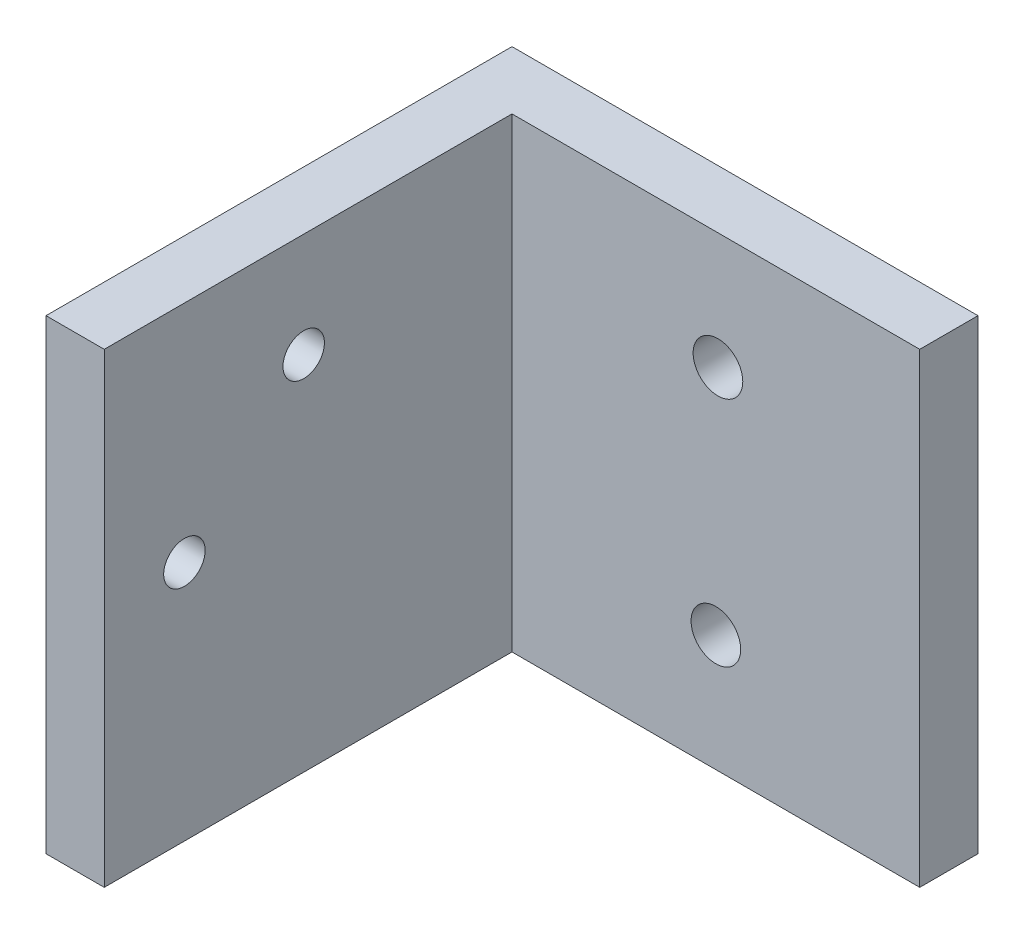
ISO-10303-21;
HEADER;
FILE_DESCRIPTION(('STEP AP214'),'2;1');
FILE_NAME('part.step','',(''),(''),'','','');
FILE_SCHEMA(('AUTOMOTIVE_DESIGN { 1 0 10303 214 1 1 1 1 }'));
ENDSEC;
DATA;
#1=APPLICATION_CONTEXT('core data for automotive mechanical design processes');
#2=APPLICATION_PROTOCOL_DEFINITION('international standard','automotive_design',2000,#1);
#3=PRODUCT_CONTEXT('',#1,'mechanical');
#4=PRODUCT('Part','Part','',(#3));
#5=PRODUCT_RELATED_PRODUCT_CATEGORY('part','',(#4));
#6=PRODUCT_DEFINITION_FORMATION('','',#4);
#7=PRODUCT_DEFINITION_CONTEXT('part definition',#1,'design');
#8=PRODUCT_DEFINITION('design','',#6,#7);
#9=PRODUCT_DEFINITION_SHAPE('','',#8);
#10=(LENGTH_UNIT() NAMED_UNIT(*) SI_UNIT(.MILLI.,.METRE.));
#11=(NAMED_UNIT(*) PLANE_ANGLE_UNIT() SI_UNIT($,.RADIAN.));
#12=(NAMED_UNIT(*) SI_UNIT($,.STERADIAN.) SOLID_ANGLE_UNIT());
#13=UNCERTAINTY_MEASURE_WITH_UNIT(LENGTH_MEASURE(1.E-05),#10,'distance_accuracy_value','');
#14=(GEOMETRIC_REPRESENTATION_CONTEXT(3) GLOBAL_UNCERTAINTY_ASSIGNED_CONTEXT((#13)) GLOBAL_UNIT_ASSIGNED_CONTEXT((#10,
#11,#12)) REPRESENTATION_CONTEXT('',''));
#15=CARTESIAN_POINT('',(0.,0.,0.));
#16=DIRECTION('',(0.,0.,1.));
#17=DIRECTION('',(1.,0.,0.));
#18=AXIS2_PLACEMENT_3D('',#15,#16,#17);
#19=CARTESIAN_POINT('',(-32.776603547062,25.4,0.));
#20=DIRECTION('',(-1.,0.,0.));
#21=DIRECTION('',(0.,0.,1.));
#22=AXIS2_PLACEMENT_3D('',#19,#20,#21);
#23=PLANE('',#22);
#24=CARTESIAN_POINT('',(-32.776603547062,19.7104,16.5203569987366));
#25=DIRECTION('',(-1.,0.,0.));
#26=DIRECTION('',(0.,0.,1.));
#27=AXIS2_PLACEMENT_3D('',#24,#25,#26);
#28=CIRCLE('',#27,1.1303);
#29=CARTESIAN_POINT('',(-32.776603547062,19.7104,17.6506569987366));
#30=VERTEX_POINT('',#29);
#31=EDGE_CURVE('E178',#30,#30,#28,.T.);
#32=ORIENTED_EDGE('',*,*,#31,.T.);
#33=EDGE_LOOP('',(#32));
#34=FACE_BOUND('',#33,.T.);
#35=CARTESIAN_POINT('',(-32.776603547062,13.1572,23.0227569987366));
#36=DIRECTION('',(-1.,0.,0.));
#37=DIRECTION('',(0.,0.,1.));
#38=AXIS2_PLACEMENT_3D('',#35,#36,#37);
#39=CIRCLE('',#38,1.1303);
#40=CARTESIAN_POINT('',(-32.776603547062,13.1572,24.1530569987366));
#41=VERTEX_POINT('',#40);
#42=EDGE_CURVE('E135',#41,#41,#39,.T.);
#43=ORIENTED_EDGE('',*,*,#42,.T.);
#44=EDGE_LOOP('',(#43));
#45=FACE_BOUND('',#44,.T.);
#46=DIRECTION('',(0.,0.,-1.));
#47=VECTOR('',#46,1.);
#48=CARTESIAN_POINT('',(-32.776603547062,0.,0.));
#49=LINE('',#48,#47);
#50=CARTESIAN_POINT('',(-32.776603547062,0.,27.3915569987366));
#51=VERTEX_POINT('',#50);
#52=CARTESIAN_POINT('',(-32.776603547062,0.,5.16655699873663));
#53=VERTEX_POINT('',#52);
#54=EDGE_CURVE('E131',#51,#53,#49,.T.);
#55=ORIENTED_EDGE('',*,*,#54,.T.);
#56=DIRECTION('',(0.,-1.,0.));
#57=VECTOR('',#56,1.);
#58=CARTESIAN_POINT('',(-32.776603547062,25.4,5.16655699873663));
#59=LINE('',#58,#57);
#60=CARTESIAN_POINT('',(-32.776603547062,25.4,5.16655699873663));
#61=VERTEX_POINT('',#60);
#62=EDGE_CURVE('E13',#61,#53,#59,.T.);
#63=ORIENTED_EDGE('',*,*,#62,.F.);
#64=DIRECTION('',(0.,0.,-1.));
#65=VECTOR('',#64,1.);
#66=CARTESIAN_POINT('',(-32.776603547062,25.4,0.));
#67=LINE('',#66,#65);
#68=CARTESIAN_POINT('',(-32.776603547062,25.4,27.3915569987366));
#69=VERTEX_POINT('',#68);
#70=EDGE_CURVE('E144',#69,#61,#67,.T.);
#71=ORIENTED_EDGE('',*,*,#70,.F.);
#72=DIRECTION('',(0.,-1.,0.));
#73=VECTOR('',#72,1.);
#74=CARTESIAN_POINT('',(-32.776603547062,25.4,27.3915569987366));
#75=LINE('',#74,#73);
#76=EDGE_CURVE('E130',#69,#51,#75,.T.);
#77=ORIENTED_EDGE('',*,*,#76,.T.);
#78=EDGE_LOOP('',(#55,#63,#71,#77));
#79=FACE_BOUND('',#78,.T.);
#80=ADVANCED_FACE('F46',(#34,#45,#79),#23,.F.);
#81=CARTESIAN_POINT('',(0.,25.4,5.16655699873663));
#82=DIRECTION('',(0.,0.,-1.));
#83=DIRECTION('',(-1.,0.,0.));
#84=AXIS2_PLACEMENT_3D('',#81,#82,#83);
#85=PLANE('',#84);
#86=CARTESIAN_POINT('',(-21.664103547062,6.35,5.16655699873663));
#87=DIRECTION('',(0.,0.,1.));
#88=DIRECTION('',(1.,0.,0.));
#89=AXIS2_PLACEMENT_3D('',#86,#87,#88);
#90=CIRCLE('',#89,1.35255);
#91=CARTESIAN_POINT('',(-20.311553547062,6.35,5.16655699873663));
#92=VERTEX_POINT('',#91);
#93=EDGE_CURVE('E198',#92,#92,#90,.T.);
#94=ORIENTED_EDGE('',*,*,#93,.F.);
#95=EDGE_LOOP('',(#94));
#96=FACE_BOUND('',#95,.T.);
#97=CARTESIAN_POINT('',(-21.5506395801981,19.05,5.16655699873663));
#98=DIRECTION('',(0.,0.,1.));
#99=DIRECTION('',(1.,0.,0.));
#100=AXIS2_PLACEMENT_3D('',#97,#98,#99);
#101=CIRCLE('',#100,1.35255);
#102=CARTESIAN_POINT('',(-20.1980895801981,19.05,5.16655699873663));
#103=VERTEX_POINT('',#102);
#104=EDGE_CURVE('E195',#103,#103,#101,.T.);
#105=ORIENTED_EDGE('',*,*,#104,.F.);
#106=EDGE_LOOP('',(#105));
#107=FACE_BOUND('',#106,.T.);
#108=DIRECTION('',(1.,0.,0.));
#109=VECTOR('',#108,1.);
#110=CARTESIAN_POINT('',(0.,0.,5.16655699873663));
#111=LINE('',#110,#109);
#112=CARTESIAN_POINT('',(-10.551603547062,0.,5.16655699873663));
#113=VERTEX_POINT('',#112);
#114=EDGE_CURVE('E134',#53,#113,#111,.T.);
#115=ORIENTED_EDGE('',*,*,#114,.T.);
#116=DIRECTION('',(0.,-1.,0.));
#117=VECTOR('',#116,1.);
#118=CARTESIAN_POINT('',(-10.551603547062,25.4,5.16655699873663));
#119=LINE('',#118,#117);
#120=CARTESIAN_POINT('',(-10.551603547062,25.4,5.16655699873663));
#121=VERTEX_POINT('',#120);
#122=EDGE_CURVE('E55',#121,#113,#119,.T.);
#123=ORIENTED_EDGE('',*,*,#122,.F.);
#124=DIRECTION('',(1.,0.,0.));
#125=VECTOR('',#124,1.);
#126=CARTESIAN_POINT('',(0.,25.4,5.16655699873663));
#127=LINE('',#126,#125);
#128=EDGE_CURVE('E99',#61,#121,#127,.T.);
#129=ORIENTED_EDGE('',*,*,#128,.F.);
#130=ORIENTED_EDGE('',*,*,#62,.T.);
#131=EDGE_LOOP('',(#115,#123,#129,#130));
#132=FACE_BOUND('',#131,.T.);
#133=ADVANCED_FACE('F151',(#96,#107,#132),#85,.F.);
#134=CARTESIAN_POINT('',(-10.551603547062,25.4,0.));
#135=DIRECTION('',(1.,0.,0.));
#136=DIRECTION('',(0.,0.,-1.));
#137=AXIS2_PLACEMENT_3D('',#134,#135,#136);
#138=PLANE('',#137);
#139=DIRECTION('',(0.,0.,1.));
#140=VECTOR('',#139,1.);
#141=CARTESIAN_POINT('',(-10.551603547062,0.,0.));
#142=LINE('',#141,#140);
#143=CARTESIAN_POINT('',(-10.551603547062,0.,1.99155699873663));
#144=VERTEX_POINT('',#143);
#145=EDGE_CURVE('E138',#144,#113,#142,.T.);
#146=ORIENTED_EDGE('',*,*,#145,.F.);
#147=DIRECTION('',(0.,-1.,0.));
#148=VECTOR('',#147,1.);
#149=CARTESIAN_POINT('',(-10.551603547062,25.4,1.99155699873663));
#150=LINE('',#149,#148);
#151=CARTESIAN_POINT('',(-10.551603547062,25.4,1.99155699873663));
#152=VERTEX_POINT('',#151);
#153=EDGE_CURVE('E115',#152,#144,#150,.T.);
#154=ORIENTED_EDGE('',*,*,#153,.F.);
#155=DIRECTION('',(0.,0.,1.));
#156=VECTOR('',#155,1.);
#157=CARTESIAN_POINT('',(-10.551603547062,25.4,0.));
#158=LINE('',#157,#156);
#159=EDGE_CURVE('E124',#152,#121,#158,.T.);
#160=ORIENTED_EDGE('',*,*,#159,.T.);
#161=ORIENTED_EDGE('',*,*,#122,.T.);
#162=EDGE_LOOP('',(#146,#154,#160,#161));
#163=FACE_BOUND('',#162,.T.);
#164=ADVANCED_FACE('F150',(#163),#138,.T.);
#165=CARTESIAN_POINT('',(0.,25.4,1.99155699873663));
#166=DIRECTION('',(0.,0.,-1.));
#167=DIRECTION('',(-1.,0.,0.));
#168=AXIS2_PLACEMENT_3D('',#165,#166,#167);
#169=PLANE('',#168);
#170=CARTESIAN_POINT('',(-21.664103547062,6.35,1.99155699873663));
#171=DIRECTION('',(0.,0.,-1.));
#172=DIRECTION('',(-1.,0.,0.));
#173=AXIS2_PLACEMENT_3D('',#170,#171,#172);
#174=CIRCLE('',#173,1.35255);
#175=CARTESIAN_POINT('',(-23.016653547062,6.35,1.99155699873663));
#176=VERTEX_POINT('',#175);
#177=EDGE_CURVE('E49',#176,#176,#174,.T.);
#178=ORIENTED_EDGE('',*,*,#177,.F.);
#179=EDGE_LOOP('',(#178));
#180=FACE_BOUND('',#179,.T.);
#181=CARTESIAN_POINT('',(-21.5506395801981,19.05,1.99155699873663));
#182=DIRECTION('',(0.,0.,-1.));
#183=DIRECTION('',(-1.,0.,0.));
#184=AXIS2_PLACEMENT_3D('',#181,#182,#183);
#185=CIRCLE('',#184,1.35255);
#186=CARTESIAN_POINT('',(-22.9031895801981,19.05,1.99155699873663));
#187=VERTEX_POINT('',#186);
#188=EDGE_CURVE('E192',#187,#187,#185,.T.);
#189=ORIENTED_EDGE('',*,*,#188,.F.);
#190=EDGE_LOOP('',(#189));
#191=FACE_BOUND('',#190,.T.);
#192=DIRECTION('',(1.,0.,0.));
#193=VECTOR('',#192,1.);
#194=CARTESIAN_POINT('',(0.,0.,1.99155699873663));
#195=LINE('',#194,#193);
#196=CARTESIAN_POINT('',(-35.9516035470619,0.,1.99155699873663));
#197=VERTEX_POINT('',#196);
#198=EDGE_CURVE('E114',#197,#144,#195,.T.);
#199=ORIENTED_EDGE('',*,*,#198,.F.);
#200=DIRECTION('',(0.,-1.,0.));
#201=VECTOR('',#200,1.);
#202=CARTESIAN_POINT('',(-35.9516035470619,25.4,1.99155699873663));
#203=LINE('',#202,#201);
#204=CARTESIAN_POINT('',(-35.9516035470619,25.4,1.99155699873663));
#205=VERTEX_POINT('',#204);
#206=EDGE_CURVE('E108',#205,#197,#203,.T.);
#207=ORIENTED_EDGE('',*,*,#206,.F.);
#208=DIRECTION('',(1.,0.,0.));
#209=VECTOR('',#208,1.);
#210=CARTESIAN_POINT('',(0.,25.4,1.99155699873663));
#211=LINE('',#210,#209);
#212=EDGE_CURVE('E112',#205,#152,#211,.T.);
#213=ORIENTED_EDGE('',*,*,#212,.T.);
#214=ORIENTED_EDGE('',*,*,#153,.T.);
#215=EDGE_LOOP('',(#199,#207,#213,#214));
#216=FACE_BOUND('',#215,.T.);
#217=ADVANCED_FACE('F110',(#180,#191,#216),#169,.T.);
#218=CARTESIAN_POINT('',(-35.9516035470619,25.4,0.));
#219=DIRECTION('',(1.,0.,0.));
#220=DIRECTION('',(0.,0.,-1.));
#221=AXIS2_PLACEMENT_3D('',#218,#219,#220);
#222=PLANE('',#221);
#223=CARTESIAN_POINT('',(-35.9516035470619,19.7104,16.5203569987366));
#224=DIRECTION('',(-1.,0.,0.));
#225=DIRECTION('',(0.,0.,1.));
#226=AXIS2_PLACEMENT_3D('',#223,#224,#225);
#227=CIRCLE('',#226,1.1303);
#228=CARTESIAN_POINT('',(-35.9516035470619,19.7104,17.6506569987366));
#229=VERTEX_POINT('',#228);
#230=EDGE_CURVE('E189',#229,#229,#227,.T.);
#231=ORIENTED_EDGE('',*,*,#230,.F.);
#232=EDGE_LOOP('',(#231));
#233=FACE_BOUND('',#232,.T.);
#234=CARTESIAN_POINT('',(-35.9516035470619,13.1572,23.0227569987366));
#235=DIRECTION('',(-1.,0.,0.));
#236=DIRECTION('',(0.,0.,1.));
#237=AXIS2_PLACEMENT_3D('',#234,#235,#236);
#238=CIRCLE('',#237,1.1303);
#239=CARTESIAN_POINT('',(-35.9516035470619,13.1572,24.1530569987366));
#240=VERTEX_POINT('',#239);
#241=EDGE_CURVE('E182',#240,#240,#238,.T.);
#242=ORIENTED_EDGE('',*,*,#241,.F.);
#243=EDGE_LOOP('',(#242));
#244=FACE_BOUND('',#243,.T.);
#245=DIRECTION('',(0.,0.,1.));
#246=VECTOR('',#245,1.);
#247=CARTESIAN_POINT('',(-35.9516035470619,0.,0.));
#248=LINE('',#247,#246);
#249=CARTESIAN_POINT('',(-35.9516035470619,0.,27.3915569987366));
#250=VERTEX_POINT('',#249);
#251=EDGE_CURVE('E85',#197,#250,#248,.T.);
#252=ORIENTED_EDGE('',*,*,#251,.T.);
#253=DIRECTION('',(0.,-1.,0.));
#254=VECTOR('',#253,1.);
#255=CARTESIAN_POINT('',(-35.9516035470619,25.4,27.3915569987366));
#256=LINE('',#255,#254);
#257=CARTESIAN_POINT('',(-35.9516035470619,25.4,27.3915569987366));
#258=VERTEX_POINT('',#257);
#259=EDGE_CURVE('E116',#258,#250,#256,.T.);
#260=ORIENTED_EDGE('',*,*,#259,.F.);
#261=DIRECTION('',(0.,0.,1.));
#262=VECTOR('',#261,1.);
#263=CARTESIAN_POINT('',(-35.9516035470619,25.4,0.));
#264=LINE('',#263,#262);
#265=EDGE_CURVE('E118',#205,#258,#264,.T.);
#266=ORIENTED_EDGE('',*,*,#265,.F.);
#267=ORIENTED_EDGE('',*,*,#206,.T.);
#268=EDGE_LOOP('',(#252,#260,#266,#267));
#269=FACE_BOUND('',#268,.T.);
#270=ADVANCED_FACE('F119',(#233,#244,#269),#222,.F.);
#271=CARTESIAN_POINT('',(0.,25.4,27.3915569987366));
#272=DIRECTION('',(0.,0.,-1.));
#273=DIRECTION('',(-1.,0.,0.));
#274=AXIS2_PLACEMENT_3D('',#271,#272,#273);
#275=PLANE('',#274);
#276=DIRECTION('',(1.,0.,0.));
#277=VECTOR('',#276,1.);
#278=CARTESIAN_POINT('',(0.,0.,27.3915569987366));
#279=LINE('',#278,#277);
#280=EDGE_CURVE('E91',#250,#51,#279,.T.);
#281=ORIENTED_EDGE('',*,*,#280,.T.);
#282=ORIENTED_EDGE('',*,*,#76,.F.);
#283=DIRECTION('',(1.,0.,0.));
#284=VECTOR('',#283,1.);
#285=CARTESIAN_POINT('',(0.,25.4,27.3915569987366));
#286=LINE('',#285,#284);
#287=EDGE_CURVE('E63',#258,#69,#286,.T.);
#288=ORIENTED_EDGE('',*,*,#287,.F.);
#289=ORIENTED_EDGE('',*,*,#259,.T.);
#290=EDGE_LOOP('',(#281,#282,#288,#289));
#291=FACE_BOUND('',#290,.T.);
#292=ADVANCED_FACE('F158',(#291),#275,.F.);
#293=CARTESIAN_POINT('',(0.,25.4,0.));
#294=DIRECTION('',(0.,1.,0.));
#295=DIRECTION('',(0.,0.,1.));
#296=AXIS2_PLACEMENT_3D('',#293,#294,#295);
#297=PLANE('',#296);
#298=ORIENTED_EDGE('',*,*,#70,.T.);
#299=ORIENTED_EDGE('',*,*,#128,.T.);
#300=ORIENTED_EDGE('',*,*,#159,.F.);
#301=ORIENTED_EDGE('',*,*,#212,.F.);
#302=ORIENTED_EDGE('',*,*,#265,.T.);
#303=ORIENTED_EDGE('',*,*,#287,.T.);
#304=EDGE_LOOP('',(#298,#299,#300,#301,#302,#303));
#305=FACE_BOUND('',#304,.T.);
#306=ADVANCED_FACE('F122',(#305),#297,.T.);
#307=CARTESIAN_POINT('',(0.,0.,0.));
#308=DIRECTION('',(0.,1.,0.));
#309=DIRECTION('',(0.,0.,1.));
#310=AXIS2_PLACEMENT_3D('',#307,#308,#309);
#311=PLANE('',#310);
#312=ORIENTED_EDGE('',*,*,#54,.F.);
#313=ORIENTED_EDGE('',*,*,#280,.F.);
#314=ORIENTED_EDGE('',*,*,#251,.F.);
#315=ORIENTED_EDGE('',*,*,#198,.T.);
#316=ORIENTED_EDGE('',*,*,#145,.T.);
#317=ORIENTED_EDGE('',*,*,#114,.F.);
#318=EDGE_LOOP('',(#312,#313,#314,#315,#316,#317));
#319=FACE_BOUND('',#318,.T.);
#320=ADVANCED_FACE('F155',(#319),#311,.F.);
#321=CARTESIAN_POINT('',(-35.9516035470619,13.1572,23.0227569987366));
#322=DIRECTION('',(-1.,0.,0.));
#323=DIRECTION('',(0.,0.,1.));
#324=AXIS2_PLACEMENT_3D('',#321,#322,#323);
#325=CYLINDRICAL_SURFACE('',#324,1.1303);
#326=ORIENTED_EDGE('',*,*,#241,.T.);
#327=EDGE_LOOP('',(#326));
#328=FACE_BOUND('',#327,.T.);
#329=ORIENTED_EDGE('',*,*,#42,.F.);
#330=EDGE_LOOP('',(#329));
#331=FACE_BOUND('',#330,.T.);
#332=ADVANCED_FACE('F224',(#328,#331),#325,.F.);
#333=CARTESIAN_POINT('',(-35.9516035470619,19.7104,16.5203569987366));
#334=DIRECTION('',(-1.,0.,0.));
#335=DIRECTION('',(0.,0.,1.));
#336=AXIS2_PLACEMENT_3D('',#333,#334,#335);
#337=CYLINDRICAL_SURFACE('',#336,1.1303);
#338=ORIENTED_EDGE('',*,*,#230,.T.);
#339=EDGE_LOOP('',(#338));
#340=FACE_BOUND('',#339,.T.);
#341=ORIENTED_EDGE('',*,*,#31,.F.);
#342=EDGE_LOOP('',(#341));
#343=FACE_BOUND('',#342,.T.);
#344=ADVANCED_FACE('F215',(#340,#343),#337,.F.);
#345=CARTESIAN_POINT('',(-21.5506395801981,19.05,5.16655699873663));
#346=DIRECTION('',(0.,0.,1.));
#347=DIRECTION('',(1.,0.,0.));
#348=AXIS2_PLACEMENT_3D('',#345,#346,#347);
#349=CYLINDRICAL_SURFACE('',#348,1.35255);
#350=ORIENTED_EDGE('',*,*,#188,.T.);
#351=EDGE_LOOP('',(#350));
#352=FACE_BOUND('',#351,.T.);
#353=ORIENTED_EDGE('',*,*,#104,.T.);
#354=EDGE_LOOP('',(#353));
#355=FACE_BOUND('',#354,.T.);
#356=ADVANCED_FACE('F212',(#352,#355),#349,.F.);
#357=CARTESIAN_POINT('',(-21.664103547062,6.35,5.16655699873663));
#358=DIRECTION('',(0.,0.,1.));
#359=DIRECTION('',(1.,0.,0.));
#360=AXIS2_PLACEMENT_3D('',#357,#358,#359);
#361=CYLINDRICAL_SURFACE('',#360,1.35255);
#362=ORIENTED_EDGE('',*,*,#177,.T.);
#363=EDGE_LOOP('',(#362));
#364=FACE_BOUND('',#363,.T.);
#365=ORIENTED_EDGE('',*,*,#93,.T.);
#366=EDGE_LOOP('',(#365));
#367=FACE_BOUND('',#366,.T.);
#368=ADVANCED_FACE('F205',(#364,#367),#361,.F.);
#369=CLOSED_SHELL('',(#80,#133,#164,#217,#270,#292,#306,#320,#332,#344,#356,#368));
#370=MANIFOLD_SOLID_BREP('B2',#369);
#371=ADVANCED_BREP_SHAPE_REPRESENTATION('',(#18,#370),#14);
#372=SHAPE_DEFINITION_REPRESENTATION(#9,#371);
ENDSEC;
END-ISO-10303-21;
